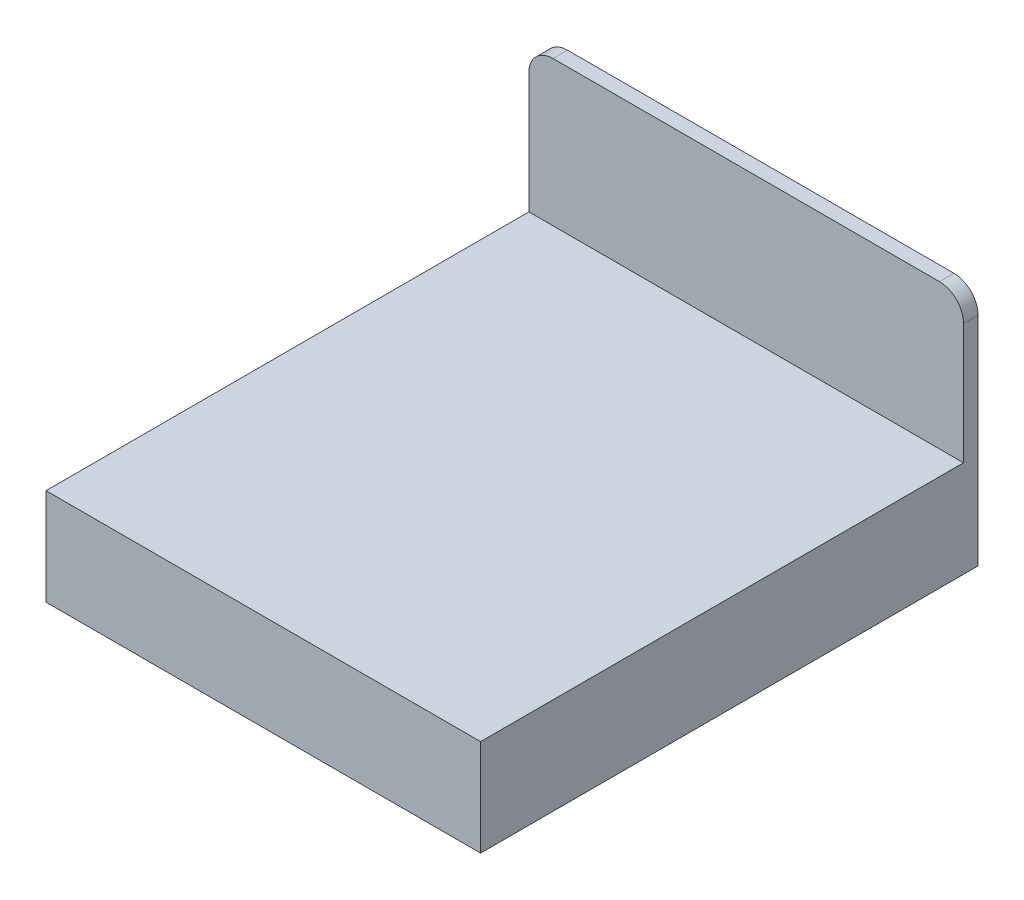
ISO-10303-21;
HEADER;
FILE_DESCRIPTION(('STEP AP214'),'2;1');
FILE_NAME('part.step','',(''),(''),'','','');
FILE_SCHEMA(('AUTOMOTIVE_DESIGN { 1 0 10303 214 1 1 1 1 }'));
ENDSEC;
DATA;
#1=APPLICATION_CONTEXT('core data for automotive mechanical design processes');
#2=APPLICATION_PROTOCOL_DEFINITION('international standard','automotive_design',2000,#1);
#3=PRODUCT_CONTEXT('',#1,'mechanical');
#4=PRODUCT('Part','Part','',(#3));
#5=PRODUCT_RELATED_PRODUCT_CATEGORY('part','',(#4));
#6=PRODUCT_DEFINITION_FORMATION('','',#4);
#7=PRODUCT_DEFINITION_CONTEXT('part definition',#1,'design');
#8=PRODUCT_DEFINITION('design','',#6,#7);
#9=PRODUCT_DEFINITION_SHAPE('','',#8);
#10=(LENGTH_UNIT() NAMED_UNIT(*) SI_UNIT(.MILLI.,.METRE.));
#11=(NAMED_UNIT(*) PLANE_ANGLE_UNIT() SI_UNIT($,.RADIAN.));
#12=(NAMED_UNIT(*) SI_UNIT($,.STERADIAN.) SOLID_ANGLE_UNIT());
#13=UNCERTAINTY_MEASURE_WITH_UNIT(LENGTH_MEASURE(1.E-05),#10,'distance_accuracy_value','');
#14=(GEOMETRIC_REPRESENTATION_CONTEXT(3) GLOBAL_UNCERTAINTY_ASSIGNED_CONTEXT((#13)) GLOBAL_UNIT_ASSIGNED_CONTEXT((#10,
#11,#12)) REPRESENTATION_CONTEXT('',''));
#15=CARTESIAN_POINT('',(0.,0.,0.));
#16=DIRECTION('',(0.,0.,1.));
#17=DIRECTION('',(1.,0.,0.));
#18=AXIS2_PLACEMENT_3D('',#15,#16,#17);
#19=CARTESIAN_POINT('',(0.,-400.,0.));
#20=DIRECTION('',(1.,0.,0.));
#21=DIRECTION('',(0.,0.,-1.));
#22=AXIS2_PLACEMENT_3D('',#19,#20,#21);
#23=PLANE('',#22);
#24=DIRECTION('',(0.,0.,-1.));
#25=VECTOR('',#24,1.);
#26=CARTESIAN_POINT('',(0.,0.,0.));
#27=LINE('',#26,#25);
#28=CARTESIAN_POINT('',(2.44929359829471E-13,0.,2000.));
#29=VERTEX_POINT('',#28);
#30=CARTESIAN_POINT('',(0.,0.,0.));
#31=VERTEX_POINT('',#30);
#32=EDGE_CURVE('E77',#29,#31,#27,.T.);
#33=ORIENTED_EDGE('',*,*,#32,.F.);
#34=DIRECTION('',(0.,1.,0.));
#35=VECTOR('',#34,1.);
#36=CARTESIAN_POINT('',(2.44929359829471E-13,-400.,2000.));
#37=LINE('',#36,#35);
#38=CARTESIAN_POINT('',(2.44929359829471E-13,-400.,2000.));
#39=VERTEX_POINT('',#38);
#40=EDGE_CURVE('E11',#39,#29,#37,.T.);
#41=ORIENTED_EDGE('',*,*,#40,.F.);
#42=DIRECTION('',(0.,0.,-1.));
#43=VECTOR('',#42,1.);
#44=CARTESIAN_POINT('',(0.,-400.,0.));
#45=LINE('',#44,#43);
#46=CARTESIAN_POINT('',(0.,-400.,-60.));
#47=VERTEX_POINT('',#46);
#48=EDGE_CURVE('E87',#39,#47,#45,.T.);
#49=ORIENTED_EDGE('',*,*,#48,.T.);
#50=DIRECTION('',(0.,-1.,0.));
#51=VECTOR('',#50,1.);
#52=CARTESIAN_POINT('',(0.,-400.,-60.));
#53=LINE('',#52,#51);
#54=CARTESIAN_POINT('',(0.,499.999999999999,-60.));
#55=VERTEX_POINT('',#54);
#56=EDGE_CURVE('E152',#55,#47,#53,.T.);
#57=ORIENTED_EDGE('',*,*,#56,.F.);
#58=DIRECTION('',(0.,0.,1.));
#59=VECTOR('',#58,1.);
#60=CARTESIAN_POINT('',(0.,499.999999999999,-60.));
#61=LINE('',#60,#59);
#62=CARTESIAN_POINT('',(0.,499.999999999999,0.));
#63=VERTEX_POINT('',#62);
#64=EDGE_CURVE('E163',#55,#63,#61,.T.);
#65=ORIENTED_EDGE('',*,*,#64,.T.);
#66=DIRECTION('',(0.,-1.,0.));
#67=VECTOR('',#66,1.);
#68=CARTESIAN_POINT('',(0.,-400.,0.));
#69=LINE('',#68,#67);
#70=EDGE_CURVE('E80',#63,#31,#69,.T.);
#71=ORIENTED_EDGE('',*,*,#70,.T.);
#72=EDGE_LOOP('',(#33,#41,#49,#57,#65,#71));
#73=FACE_BOUND('',#72,.T.);
#74=ADVANCED_FACE('F36',(#73),#23,.T.);
#75=CARTESIAN_POINT('',(2.44929359829471E-13,-400.,2000.));
#76=DIRECTION('',(0.,0.,1.));
#77=DIRECTION('',(1.,0.,0.));
#78=AXIS2_PLACEMENT_3D('',#75,#76,#77);
#79=PLANE('',#78);
#80=DIRECTION('',(1.,0.,0.));
#81=VECTOR('',#80,1.);
#82=CARTESIAN_POINT('',(2.44929359829471E-13,0.,2000.));
#83=LINE('',#82,#81);
#84=CARTESIAN_POINT('',(-1800.,0.,2000.));
#85=VERTEX_POINT('',#84);
#86=EDGE_CURVE('E72',#85,#29,#83,.T.);
#87=ORIENTED_EDGE('',*,*,#86,.F.);
#88=DIRECTION('',(0.,1.,0.));
#89=VECTOR('',#88,1.);
#90=CARTESIAN_POINT('',(-1800.,-400.,2000.));
#91=LINE('',#90,#89);
#92=CARTESIAN_POINT('',(-1800.,-400.,2000.));
#93=VERTEX_POINT('',#92);
#94=EDGE_CURVE('E45',#93,#85,#91,.T.);
#95=ORIENTED_EDGE('',*,*,#94,.F.);
#96=DIRECTION('',(1.,0.,0.));
#97=VECTOR('',#96,1.);
#98=CARTESIAN_POINT('',(2.44929359829471E-13,-400.,2000.));
#99=LINE('',#98,#97);
#100=EDGE_CURVE('E74',#93,#39,#99,.T.);
#101=ORIENTED_EDGE('',*,*,#100,.T.);
#102=ORIENTED_EDGE('',*,*,#40,.T.);
#103=EDGE_LOOP('',(#87,#95,#101,#102));
#104=FACE_BOUND('',#103,.T.);
#105=ADVANCED_FACE('F70',(#104),#79,.T.);
#106=CARTESIAN_POINT('',(-1800.,-400.,2.20436423846524E-13));
#107=DIRECTION('',(-1.,0.,0.));
#108=DIRECTION('',(0.,0.,1.));
#109=AXIS2_PLACEMENT_3D('',#106,#107,#108);
#110=PLANE('',#109);
#111=DIRECTION('',(0.,0.,1.));
#112=VECTOR('',#111,1.);
#113=CARTESIAN_POINT('',(-1800.,0.,2.20436423846524E-13));
#114=LINE('',#113,#112);
#115=CARTESIAN_POINT('',(-1800.,0.,2.20436423846524E-13));
#116=VERTEX_POINT('',#115);
#117=EDGE_CURVE('E86',#116,#85,#114,.T.);
#118=ORIENTED_EDGE('',*,*,#117,.F.);
#119=DIRECTION('',(0.,1.,0.));
#120=VECTOR('',#119,1.);
#121=CARTESIAN_POINT('',(-1800.,-400.,2.20436423846524E-13));
#122=LINE('',#121,#120);
#123=CARTESIAN_POINT('',(-1800.,499.999999999999,2.20436423846524E-13));
#124=VERTEX_POINT('',#123);
#125=EDGE_CURVE('E106',#116,#124,#122,.T.);
#126=ORIENTED_EDGE('',*,*,#125,.T.);
#127=DIRECTION('',(0.,0.,1.));
#128=VECTOR('',#127,1.);
#129=CARTESIAN_POINT('',(-1800.,499.999999999999,-59.9999999999998));
#130=LINE('',#129,#128);
#131=CARTESIAN_POINT('',(-1800.,499.999999999999,-59.9999999999998));
#132=VERTEX_POINT('',#131);
#133=EDGE_CURVE('E84',#132,#124,#130,.T.);
#134=ORIENTED_EDGE('',*,*,#133,.F.);
#135=DIRECTION('',(0.,1.,0.));
#136=VECTOR('',#135,1.);
#137=CARTESIAN_POINT('',(-1800.,-400.,-59.9999999999998));
#138=LINE('',#137,#136);
#139=CARTESIAN_POINT('',(-1800.,-400.,-59.9999999999998));
#140=VERTEX_POINT('',#139);
#141=EDGE_CURVE('E142',#140,#132,#138,.T.);
#142=ORIENTED_EDGE('',*,*,#141,.F.);
#143=DIRECTION('',(0.,0.,1.));
#144=VECTOR('',#143,1.);
#145=CARTESIAN_POINT('',(-1800.,-400.,2.20436423846524E-13));
#146=LINE('',#145,#144);
#147=EDGE_CURVE('E89',#140,#93,#146,.T.);
#148=ORIENTED_EDGE('',*,*,#147,.T.);
#149=ORIENTED_EDGE('',*,*,#94,.T.);
#150=EDGE_LOOP('',(#118,#126,#134,#142,#148,#149));
#151=FACE_BOUND('',#150,.T.);
#152=ADVANCED_FACE('F143',(#151),#110,.T.);
#153=CARTESIAN_POINT('',(0.,-400.,0.));
#154=DIRECTION('',(0.,-1.,0.));
#155=DIRECTION('',(0.,0.,-1.));
#156=AXIS2_PLACEMENT_3D('',#153,#154,#155);
#157=PLANE('',#156);
#158=ORIENTED_EDGE('',*,*,#48,.F.);
#159=ORIENTED_EDGE('',*,*,#100,.F.);
#160=ORIENTED_EDGE('',*,*,#147,.F.);
#161=DIRECTION('',(-1.,0.,0.));
#162=VECTOR('',#161,1.);
#163=CARTESIAN_POINT('',(-1800.,-400.,-59.9999999999998));
#164=LINE('',#163,#162);
#165=EDGE_CURVE('E139',#47,#140,#164,.T.);
#166=ORIENTED_EDGE('',*,*,#165,.F.);
#167=EDGE_LOOP('',(#158,#159,#160,#166));
#168=FACE_BOUND('',#167,.T.);
#169=ADVANCED_FACE('F137',(#168),#157,.T.);
#170=CARTESIAN_POINT('',(0.,0.,0.));
#171=DIRECTION('',(0.,-1.,0.));
#172=DIRECTION('',(0.,0.,-1.));
#173=AXIS2_PLACEMENT_3D('',#170,#171,#172);
#174=PLANE('',#173);
#175=ORIENTED_EDGE('',*,*,#32,.T.);
#176=DIRECTION('',(-1.,0.,0.));
#177=VECTOR('',#176,1.);
#178=CARTESIAN_POINT('',(0.,0.,0.));
#179=LINE('',#178,#177);
#180=EDGE_CURVE('E83',#31,#116,#179,.T.);
#181=ORIENTED_EDGE('',*,*,#180,.T.);
#182=ORIENTED_EDGE('',*,*,#117,.T.);
#183=ORIENTED_EDGE('',*,*,#86,.T.);
#184=EDGE_LOOP('',(#175,#181,#182,#183));
#185=FACE_BOUND('',#184,.T.);
#186=ADVANCED_FACE('F85',(#185),#174,.F.);
#187=CARTESIAN_POINT('',(-1700.,500.,-59.9999999999998));
#188=DIRECTION('',(0.,0.,1.));
#189=DIRECTION('',(1.,0.,0.));
#190=AXIS2_PLACEMENT_3D('',#187,#188,#189);
#191=CYLINDRICAL_SURFACE('',#190,100.);
#192=CARTESIAN_POINT('',(-1700.,500.,2.0818995585505E-13));
#193=DIRECTION('',(0.,0.,-1.));
#194=DIRECTION('',(-1.,0.,0.));
#195=AXIS2_PLACEMENT_3D('',#192,#193,#194);
#196=CIRCLE('',#195,100.);
#197=CARTESIAN_POINT('',(-1700.,600.,2.0818995585505E-13));
#198=VERTEX_POINT('',#197);
#199=EDGE_CURVE('E166',#124,#198,#196,.T.);
#200=ORIENTED_EDGE('',*,*,#199,.T.);
#201=DIRECTION('',(0.,0.,1.));
#202=VECTOR('',#201,1.);
#203=CARTESIAN_POINT('',(-1700.,600.,-59.9999999999998));
#204=LINE('',#203,#202);
#205=CARTESIAN_POINT('',(-1700.,600.,-59.9999999999998));
#206=VERTEX_POINT('',#205);
#207=EDGE_CURVE('E178',#206,#198,#204,.T.);
#208=ORIENTED_EDGE('',*,*,#207,.F.);
#209=CARTESIAN_POINT('',(-1700.,500.,-59.9999999999998));
#210=DIRECTION('',(0.,0.,-1.));
#211=DIRECTION('',(-1.,0.,0.));
#212=AXIS2_PLACEMENT_3D('',#209,#210,#211);
#213=CIRCLE('',#212,100.);
#214=EDGE_CURVE('E147',#132,#206,#213,.T.);
#215=ORIENTED_EDGE('',*,*,#214,.F.);
#216=ORIENTED_EDGE('',*,*,#133,.T.);
#217=EDGE_LOOP('',(#200,#208,#215,#216));
#218=FACE_BOUND('',#217,.T.);
#219=ADVANCED_FACE('F185',(#218),#191,.T.);
#220=CARTESIAN_POINT('',(-1700.,600.,-59.9999999999998));
#221=DIRECTION('',(0.,-1.,0.));
#222=DIRECTION('',(1.,0.,0.));
#223=AXIS2_PLACEMENT_3D('',#220,#221,#222);
#224=PLANE('',#223);
#225=DIRECTION('',(1.,0.,0.));
#226=VECTOR('',#225,1.);
#227=CARTESIAN_POINT('',(-1700.,600.,2.0818995585505E-13));
#228=LINE('',#227,#226);
#229=CARTESIAN_POINT('',(-100.000000000001,600.,0.));
#230=VERTEX_POINT('',#229);
#231=EDGE_CURVE('E186',#198,#230,#228,.T.);
#232=ORIENTED_EDGE('',*,*,#231,.T.);
#233=DIRECTION('',(0.,0.,1.));
#234=VECTOR('',#233,1.);
#235=CARTESIAN_POINT('',(-100.000000000001,600.,-60.));
#236=LINE('',#235,#234);
#237=CARTESIAN_POINT('',(-100.000000000001,600.,-60.));
#238=VERTEX_POINT('',#237);
#239=EDGE_CURVE('E176',#238,#230,#236,.T.);
#240=ORIENTED_EDGE('',*,*,#239,.F.);
#241=DIRECTION('',(1.,0.,0.));
#242=VECTOR('',#241,1.);
#243=CARTESIAN_POINT('',(-1700.,600.,-59.9999999999998));
#244=LINE('',#243,#242);
#245=EDGE_CURVE('E158',#206,#238,#244,.T.);
#246=ORIENTED_EDGE('',*,*,#245,.F.);
#247=ORIENTED_EDGE('',*,*,#207,.T.);
#248=EDGE_LOOP('',(#232,#240,#246,#247));
#249=FACE_BOUND('',#248,.T.);
#250=ADVANCED_FACE('F192',(#249),#224,.F.);
#251=CARTESIAN_POINT('',(-100.,500.,-60.));
#252=DIRECTION('',(0.,0.,1.));
#253=DIRECTION('',(1.,0.,0.));
#254=AXIS2_PLACEMENT_3D('',#251,#252,#253);
#255=CYLINDRICAL_SURFACE('',#254,100.);
#256=CARTESIAN_POINT('',(-100.,500.,0.));
#257=DIRECTION('',(0.,0.,-1.));
#258=DIRECTION('',(-1.,0.,0.));
#259=AXIS2_PLACEMENT_3D('',#256,#257,#258);
#260=CIRCLE('',#259,100.);
#261=EDGE_CURVE('E154',#230,#63,#260,.T.);
#262=ORIENTED_EDGE('',*,*,#261,.T.);
#263=ORIENTED_EDGE('',*,*,#64,.F.);
#264=CARTESIAN_POINT('',(-100.,500.,-60.));
#265=DIRECTION('',(0.,0.,-1.));
#266=DIRECTION('',(-1.,0.,0.));
#267=AXIS2_PLACEMENT_3D('',#264,#265,#266);
#268=CIRCLE('',#267,100.);
#269=EDGE_CURVE('E160',#238,#55,#268,.T.);
#270=ORIENTED_EDGE('',*,*,#269,.F.);
#271=ORIENTED_EDGE('',*,*,#239,.T.);
#272=EDGE_LOOP('',(#262,#263,#270,#271));
#273=FACE_BOUND('',#272,.T.);
#274=ADVANCED_FACE('F190',(#273),#255,.T.);
#275=CARTESIAN_POINT('',(-100.,500.,-60.));
#276=DIRECTION('',(0.,0.,-1.));
#277=DIRECTION('',(-1.,0.,0.));
#278=AXIS2_PLACEMENT_3D('',#275,#276,#277);
#279=PLANE('',#278);
#280=ORIENTED_EDGE('',*,*,#165,.T.);
#281=ORIENTED_EDGE('',*,*,#141,.T.);
#282=ORIENTED_EDGE('',*,*,#214,.T.);
#283=ORIENTED_EDGE('',*,*,#245,.T.);
#284=ORIENTED_EDGE('',*,*,#269,.T.);
#285=ORIENTED_EDGE('',*,*,#56,.T.);
#286=EDGE_LOOP('',(#280,#281,#282,#283,#284,#285));
#287=FACE_BOUND('',#286,.T.);
#288=ADVANCED_FACE('F150',(#287),#279,.T.);
#289=CARTESIAN_POINT('',(-100.,500.,0.));
#290=DIRECTION('',(0.,0.,-1.));
#291=DIRECTION('',(-1.,0.,0.));
#292=AXIS2_PLACEMENT_3D('',#289,#290,#291);
#293=PLANE('',#292);
#294=ORIENTED_EDGE('',*,*,#180,.F.);
#295=ORIENTED_EDGE('',*,*,#70,.F.);
#296=ORIENTED_EDGE('',*,*,#261,.F.);
#297=ORIENTED_EDGE('',*,*,#231,.F.);
#298=ORIENTED_EDGE('',*,*,#199,.F.);
#299=ORIENTED_EDGE('',*,*,#125,.F.);
#300=EDGE_LOOP('',(#294,#295,#296,#297,#298,#299));
#301=FACE_BOUND('',#300,.T.);
#302=ADVANCED_FACE('F101',(#301),#293,.F.);
#303=CLOSED_SHELL('',(#74,#105,#152,#169,#186,#219,#250,#274,#288,#302));
#304=MANIFOLD_SOLID_BREP('B2',#303);
#305=ADVANCED_BREP_SHAPE_REPRESENTATION('',(#18,#304),#14);
#306=SHAPE_DEFINITION_REPRESENTATION(#9,#305);
ENDSEC;
END-ISO-10303-21;
